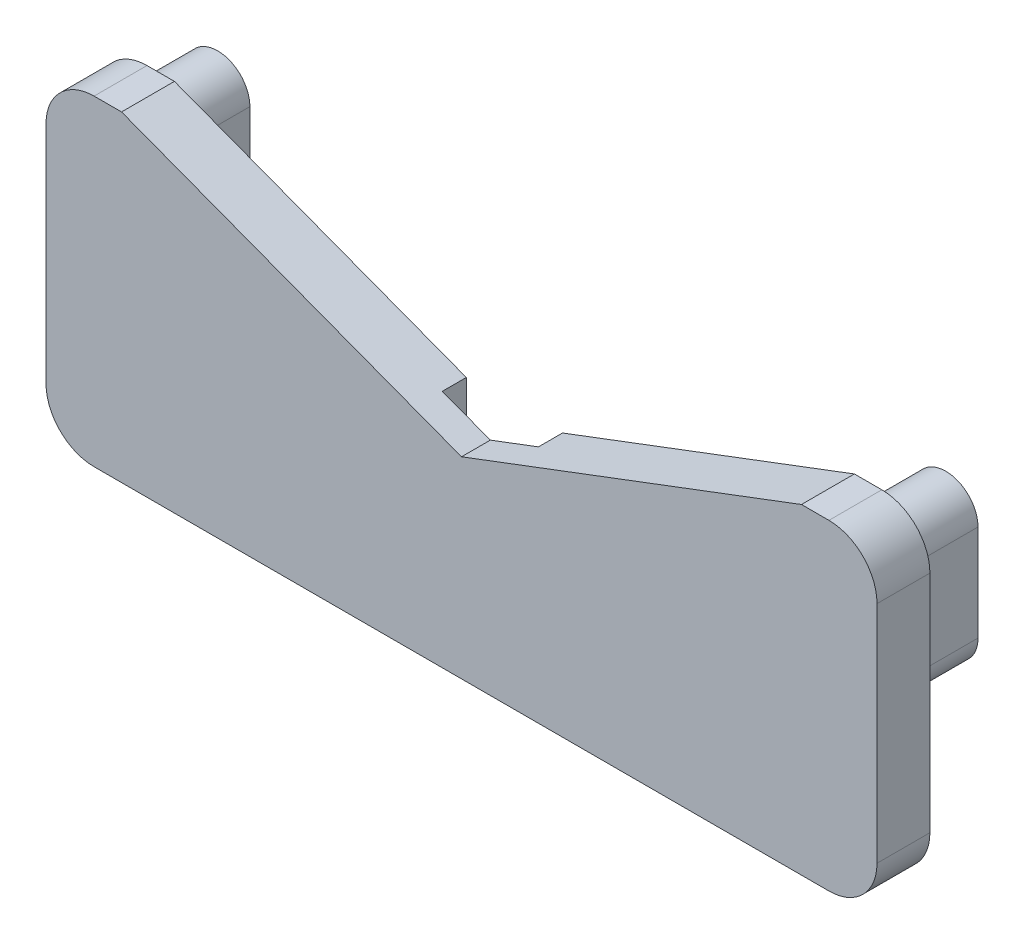
ISO-10303-21;
HEADER;
FILE_DESCRIPTION(('STEP AP214'),'2;1');
FILE_NAME('part.step','',(''),(''),'','','');
FILE_SCHEMA(('AUTOMOTIVE_DESIGN { 1 0 10303 214 1 1 1 1 }'));
ENDSEC;
DATA;
#1=APPLICATION_CONTEXT('core data for automotive mechanical design processes');
#2=APPLICATION_PROTOCOL_DEFINITION('international standard','automotive_design',2000,#1);
#3=PRODUCT_CONTEXT('',#1,'mechanical');
#4=PRODUCT('Part','Part','',(#3));
#5=PRODUCT_RELATED_PRODUCT_CATEGORY('part','',(#4));
#6=PRODUCT_DEFINITION_FORMATION('','',#4);
#7=PRODUCT_DEFINITION_CONTEXT('part definition',#1,'design');
#8=PRODUCT_DEFINITION('design','',#6,#7);
#9=PRODUCT_DEFINITION_SHAPE('','',#8);
#10=(LENGTH_UNIT() NAMED_UNIT(*) SI_UNIT(.MILLI.,.METRE.));
#11=(NAMED_UNIT(*) PLANE_ANGLE_UNIT() SI_UNIT($,.RADIAN.));
#12=(NAMED_UNIT(*) SI_UNIT($,.STERADIAN.) SOLID_ANGLE_UNIT());
#13=UNCERTAINTY_MEASURE_WITH_UNIT(LENGTH_MEASURE(1.E-05),#10,'distance_accuracy_value','');
#14=(GEOMETRIC_REPRESENTATION_CONTEXT(3) GLOBAL_UNCERTAINTY_ASSIGNED_CONTEXT((#13)) GLOBAL_UNIT_ASSIGNED_CONTEXT((#10,
#11,#12)) REPRESENTATION_CONTEXT('',''));
#15=CARTESIAN_POINT('',(0.,0.,0.));
#16=DIRECTION('',(0.,0.,1.));
#17=DIRECTION('',(1.,0.,0.));
#18=AXIS2_PLACEMENT_3D('',#15,#16,#17);
#19=CARTESIAN_POINT('',(-38.2,11.6881792815469,2.5));
#20=DIRECTION('',(0.,0.,1.));
#21=DIRECTION('',(1.,0.,0.));
#22=AXIS2_PLACEMENT_3D('',#19,#20,#21);
#23=PLANE('',#22);
#24=DIRECTION('',(0.,-1.,0.));
#25=VECTOR('',#24,1.);
#26=CARTESIAN_POINT('',(5.,0.,2.5));
#27=LINE('',#26,#25);
#28=CARTESIAN_POINT('',(5.,5.20398691330567,2.5));
#29=VERTEX_POINT('',#28);
#30=CARTESIAN_POINT('',(5.,-16.6881792815469,2.5));
#31=VERTEX_POINT('',#30);
#32=EDGE_CURVE('E261',#29,#31,#27,.T.);
#33=ORIENTED_EDGE('',*,*,#32,.T.);
#34=DIRECTION('',(-1.,0.,0.));
#35=VECTOR('',#34,1.);
#36=CARTESIAN_POINT('',(0.,-16.6881792815469,2.5));
#37=LINE('',#36,#35);
#38=CARTESIAN_POINT('',(-5.,-16.6881792815469,2.5));
#39=VERTEX_POINT('',#38);
#40=EDGE_CURVE('E287',#31,#39,#37,.T.);
#41=ORIENTED_EDGE('',*,*,#40,.T.);
#42=DIRECTION('',(0.,-1.,0.));
#43=VECTOR('',#42,1.);
#44=CARTESIAN_POINT('',(-5.,0.,2.5));
#45=LINE('',#44,#43);
#46=CARTESIAN_POINT('',(-5.,5.20398691330567,2.5));
#47=VERTEX_POINT('',#46);
#48=EDGE_CURVE('E337',#47,#39,#45,.T.);
#49=ORIENTED_EDGE('',*,*,#48,.F.);
#50=DIRECTION('',(-0.935269273451054,0.353936980461688,0.));
#51=VECTOR('',#50,1.);
#52=CARTESIAN_POINT('',(1.09630003212957,2.89694434641078,2.5));
#53=LINE('',#52,#51);
#54=CARTESIAN_POINT('',(0.,3.31182071845306,2.5));
#55=VERTEX_POINT('',#54);
#56=EDGE_CURVE('E292',#55,#47,#53,.T.);
#57=ORIENTED_EDGE('',*,*,#56,.F.);
#58=DIRECTION('',(-0.935269273451054,-0.353936980461688,0.));
#59=VECTOR('',#58,1.);
#60=CARTESIAN_POINT('',(-1.09630003212957,2.89694434641079,2.5));
#61=LINE('',#60,#59);
#62=EDGE_CURVE('E320',#29,#55,#61,.T.);
#63=ORIENTED_EDGE('',*,*,#62,.F.);
#64=EDGE_LOOP('',(#33,#41,#49,#57,#63));
#65=FACE_BOUND('',#64,.T.);
#66=ADVANCED_FACE('F36',(#65),#23,.F.);
#67=CARTESIAN_POINT('',(-38.2,11.6881792815469,2.5));
#68=DIRECTION('',(0.,0.,-1.));
#69=DIRECTION('',(-1.,0.,0.));
#70=AXIS2_PLACEMENT_3D('',#67,#68,#69);
#71=CYLINDRICAL_SURFACE('',#70,5.);
#72=CARTESIAN_POINT('',(-38.2,11.6881792815469,0.));
#73=DIRECTION('',(0.,0.,1.));
#74=DIRECTION('',(1.,0.,0.));
#75=AXIS2_PLACEMENT_3D('',#72,#73,#74);
#76=CIRCLE('',#75,5.);
#77=CARTESIAN_POINT('',(-43.2,11.6881792815469,0.));
#78=VERTEX_POINT('',#77);
#79=CARTESIAN_POINT('',(-38.2,16.6881792815469,0.));
#80=VERTEX_POINT('',#79);
#81=EDGE_CURVE('E336',#78,#80,#76,.F.);
#82=ORIENTED_EDGE('',*,*,#81,.F.);
#83=DIRECTION('',(0.,0.,-1.));
#84=VECTOR('',#83,1.);
#85=CARTESIAN_POINT('',(-43.2,11.6881792815469,2.5));
#86=LINE('',#85,#84);
#87=CARTESIAN_POINT('',(-43.2,11.6881792815469,5.5));
#88=VERTEX_POINT('',#87);
#89=EDGE_CURVE('E11',#88,#78,#86,.T.);
#90=ORIENTED_EDGE('',*,*,#89,.F.);
#91=CARTESIAN_POINT('',(-38.2,11.6881792815469,5.5));
#92=DIRECTION('',(0.,0.,1.));
#93=DIRECTION('',(1.,0.,0.));
#94=AXIS2_PLACEMENT_3D('',#91,#92,#93);
#95=CIRCLE('',#94,5.);
#96=CARTESIAN_POINT('',(-38.2,16.6881792815469,5.5));
#97=VERTEX_POINT('',#96);
#98=EDGE_CURVE('E291',#97,#88,#95,.T.);
#99=ORIENTED_EDGE('',*,*,#98,.F.);
#100=DIRECTION('',(0.,0.,-1.));
#101=VECTOR('',#100,1.);
#102=CARTESIAN_POINT('',(-38.2,16.6881792815469,2.5));
#103=LINE('',#102,#101);
#104=EDGE_CURVE('E340',#97,#80,#103,.T.);
#105=ORIENTED_EDGE('',*,*,#104,.T.);
#106=EDGE_LOOP('',(#82,#90,#99,#105));
#107=FACE_BOUND('',#106,.T.);
#108=ADVANCED_FACE('F38',(#107),#71,.T.);
#109=CARTESIAN_POINT('',(-43.2,0.,2.5));
#110=DIRECTION('',(-1.,0.,0.));
#111=DIRECTION('',(0.,0.,1.));
#112=AXIS2_PLACEMENT_3D('',#109,#110,#111);
#113=PLANE('',#112);
#114=DIRECTION('',(0.,1.,0.));
#115=VECTOR('',#114,1.);
#116=CARTESIAN_POINT('',(-43.2,0.,0.));
#117=LINE('',#116,#115);
#118=CARTESIAN_POINT('',(-43.2,-11.6881792815469,0.));
#119=VERTEX_POINT('',#118);
#120=EDGE_CURVE('E344',#119,#78,#117,.T.);
#121=ORIENTED_EDGE('',*,*,#120,.F.);
#122=DIRECTION('',(0.,0.,-1.));
#123=VECTOR('',#122,1.);
#124=CARTESIAN_POINT('',(-43.2,-11.6881792815469,2.5));
#125=LINE('',#124,#123);
#126=CARTESIAN_POINT('',(-43.2,-11.6881792815469,5.5));
#127=VERTEX_POINT('',#126);
#128=EDGE_CURVE('E44',#127,#119,#125,.T.);
#129=ORIENTED_EDGE('',*,*,#128,.F.);
#130=DIRECTION('',(0.,-1.,0.));
#131=VECTOR('',#130,1.);
#132=CARTESIAN_POINT('',(-43.2,0.,5.5));
#133=LINE('',#132,#131);
#134=EDGE_CURVE('E295',#88,#127,#133,.T.);
#135=ORIENTED_EDGE('',*,*,#134,.F.);
#136=ORIENTED_EDGE('',*,*,#89,.T.);
#137=EDGE_LOOP('',(#121,#129,#135,#136));
#138=FACE_BOUND('',#137,.T.);
#139=ADVANCED_FACE('F376',(#138),#113,.T.);
#140=CARTESIAN_POINT('',(-38.2,-11.6881792815469,2.5));
#141=DIRECTION('',(0.,0.,-1.));
#142=DIRECTION('',(-1.,0.,0.));
#143=AXIS2_PLACEMENT_3D('',#140,#141,#142);
#144=CYLINDRICAL_SURFACE('',#143,5.);
#145=CARTESIAN_POINT('',(-38.2,-11.6881792815469,0.));
#146=DIRECTION('',(0.,0.,1.));
#147=DIRECTION('',(1.,0.,0.));
#148=AXIS2_PLACEMENT_3D('',#145,#146,#147);
#149=CIRCLE('',#148,5.);
#150=CARTESIAN_POINT('',(-38.2,-16.6881792815469,0.));
#151=VERTEX_POINT('',#150);
#152=EDGE_CURVE('E347',#151,#119,#149,.F.);
#153=ORIENTED_EDGE('',*,*,#152,.F.);
#154=DIRECTION('',(0.,0.,-1.));
#155=VECTOR('',#154,1.);
#156=CARTESIAN_POINT('',(-38.2,-16.6881792815469,2.5));
#157=LINE('',#156,#155);
#158=CARTESIAN_POINT('',(-38.2,-16.6881792815469,5.5));
#159=VERTEX_POINT('',#158);
#160=EDGE_CURVE('E368',#159,#151,#157,.T.);
#161=ORIENTED_EDGE('',*,*,#160,.F.);
#162=CARTESIAN_POINT('',(-38.2,-11.6881792815469,5.5));
#163=DIRECTION('',(0.,0.,1.));
#164=DIRECTION('',(1.,0.,0.));
#165=AXIS2_PLACEMENT_3D('',#162,#163,#164);
#166=CIRCLE('',#165,5.);
#167=EDGE_CURVE('E298',#127,#159,#166,.T.);
#168=ORIENTED_EDGE('',*,*,#167,.F.);
#169=ORIENTED_EDGE('',*,*,#128,.T.);
#170=EDGE_LOOP('',(#153,#161,#168,#169));
#171=FACE_BOUND('',#170,.T.);
#172=ADVANCED_FACE('F373',(#171),#144,.T.);
#173=CARTESIAN_POINT('',(0.,-16.6881792815469,2.5));
#174=DIRECTION('',(0.,1.,0.));
#175=DIRECTION('',(0.,0.,1.));
#176=AXIS2_PLACEMENT_3D('',#173,#174,#175);
#177=PLANE('',#176);
#178=DIRECTION('',(1.,0.,0.));
#179=VECTOR('',#178,1.);
#180=CARTESIAN_POINT('',(0.,-16.6881792815469,0.));
#181=LINE('',#180,#179);
#182=CARTESIAN_POINT('',(-5.,-16.6881792815469,0.));
#183=VERTEX_POINT('',#182);
#184=EDGE_CURVE('E350',#151,#183,#181,.T.);
#185=ORIENTED_EDGE('',*,*,#184,.T.);
#186=DIRECTION('',(0.,0.,-1.));
#187=VECTOR('',#186,1.);
#188=CARTESIAN_POINT('',(-5.,-16.6881792815469,2.5));
#189=LINE('',#188,#187);
#190=EDGE_CURVE('E366',#39,#183,#189,.T.);
#191=ORIENTED_EDGE('',*,*,#190,.F.);
#192=ORIENTED_EDGE('',*,*,#40,.F.);
#193=DIRECTION('',(0.,0.,-1.));
#194=VECTOR('',#193,1.);
#195=CARTESIAN_POINT('',(5.,-16.6881792815469,2.5));
#196=LINE('',#195,#194);
#197=CARTESIAN_POINT('',(5.,-16.6881792815469,0.));
#198=VERTEX_POINT('',#197);
#199=EDGE_CURVE('E263',#31,#198,#196,.T.);
#200=ORIENTED_EDGE('',*,*,#199,.T.);
#201=DIRECTION('',(1.,0.,0.));
#202=VECTOR('',#201,1.);
#203=CARTESIAN_POINT('',(0.,-16.6881792815469,0.));
#204=LINE('',#203,#202);
#205=CARTESIAN_POINT('',(38.2,-16.6881792815469,0.));
#206=VERTEX_POINT('',#205);
#207=EDGE_CURVE('E275',#198,#206,#204,.T.);
#208=ORIENTED_EDGE('',*,*,#207,.T.);
#209=DIRECTION('',(0.,0.,-1.));
#210=VECTOR('',#209,1.);
#211=CARTESIAN_POINT('',(38.2,-16.6881792815469,5.5));
#212=LINE('',#211,#210);
#213=CARTESIAN_POINT('',(38.2,-16.6881792815469,5.5));
#214=VERTEX_POINT('',#213);
#215=EDGE_CURVE('E334',#214,#206,#212,.T.);
#216=ORIENTED_EDGE('',*,*,#215,.F.);
#217=DIRECTION('',(-1.,0.,0.));
#218=VECTOR('',#217,1.);
#219=CARTESIAN_POINT('',(0.,-16.6881792815469,5.5));
#220=LINE('',#219,#218);
#221=EDGE_CURVE('E301',#214,#159,#220,.T.);
#222=ORIENTED_EDGE('',*,*,#221,.T.);
#223=ORIENTED_EDGE('',*,*,#160,.T.);
#224=EDGE_LOOP('',(#185,#191,#192,#200,#208,#216,#222,#223));
#225=FACE_BOUND('',#224,.T.);
#226=ADVANCED_FACE('F384',(#225),#177,.F.);
#227=CARTESIAN_POINT('',(-5.,0.,2.5));
#228=DIRECTION('',(1.,0.,0.));
#229=DIRECTION('',(0.,1.,0.));
#230=AXIS2_PLACEMENT_3D('',#227,#228,#229);
#231=PLANE('',#230);
#232=DIRECTION('',(0.,-1.,0.));
#233=VECTOR('',#232,1.);
#234=CARTESIAN_POINT('',(-5.,0.,0.));
#235=LINE('',#234,#233);
#236=CARTESIAN_POINT('',(-5.,5.20398691330567,0.));
#237=VERTEX_POINT('',#236);
#238=EDGE_CURVE('E353',#237,#183,#235,.T.);
#239=ORIENTED_EDGE('',*,*,#238,.F.);
#240=DIRECTION('',(0.,0.,-1.));
#241=VECTOR('',#240,1.);
#242=CARTESIAN_POINT('',(-5.,5.20398691330567,2.5));
#243=LINE('',#242,#241);
#244=EDGE_CURVE('E364',#47,#237,#243,.T.);
#245=ORIENTED_EDGE('',*,*,#244,.F.);
#246=ORIENTED_EDGE('',*,*,#48,.T.);
#247=ORIENTED_EDGE('',*,*,#190,.T.);
#248=EDGE_LOOP('',(#239,#245,#246,#247));
#249=FACE_BOUND('',#248,.T.);
#250=ADVANCED_FACE('F402',(#249),#231,.T.);
#251=CARTESIAN_POINT('',(1.09630003212957,2.89694434641078,2.5));
#252=DIRECTION('',(0.353936980461688,0.935269273451054,0.));
#253=DIRECTION('',(-0.935269273451054,0.353936980461688,0.));
#254=AXIS2_PLACEMENT_3D('',#251,#252,#253);
#255=PLANE('',#254);
#256=DIRECTION('',(0.935269273451054,-0.353936980461688,0.));
#257=VECTOR('',#256,1.);
#258=CARTESIAN_POINT('',(1.09630003212957,2.89694434641078,0.));
#259=LINE('',#258,#257);
#260=CARTESIAN_POINT('',(-35.3466799044464,16.6881792815469,0.));
#261=VERTEX_POINT('',#260);
#262=EDGE_CURVE('E356',#261,#237,#259,.T.);
#263=ORIENTED_EDGE('',*,*,#262,.F.);
#264=DIRECTION('',(0.,0.,-1.));
#265=VECTOR('',#264,1.);
#266=CARTESIAN_POINT('',(-35.3466799044464,16.6881792815469,2.5));
#267=LINE('',#266,#265);
#268=CARTESIAN_POINT('',(-35.3466799044464,16.6881792815469,5.5));
#269=VERTEX_POINT('',#268);
#270=EDGE_CURVE('E362',#269,#261,#267,.T.);
#271=ORIENTED_EDGE('',*,*,#270,.F.);
#272=DIRECTION('',(-0.935269273451054,0.353936980461688,0.));
#273=VECTOR('',#272,1.);
#274=CARTESIAN_POINT('',(1.09630003212957,2.89694434641078,5.5));
#275=LINE('',#274,#273);
#276=CARTESIAN_POINT('',(0.,3.31182071845306,5.5));
#277=VERTEX_POINT('',#276);
#278=EDGE_CURVE('E315',#277,#269,#275,.T.);
#279=ORIENTED_EDGE('',*,*,#278,.F.);
#280=DIRECTION('',(0.,0.,-1.));
#281=VECTOR('',#280,1.);
#282=CARTESIAN_POINT('',(0.,3.31182071845306,5.5));
#283=LINE('',#282,#281);
#284=EDGE_CURVE('E318',#277,#55,#283,.T.);
#285=ORIENTED_EDGE('',*,*,#284,.T.);
#286=ORIENTED_EDGE('',*,*,#56,.T.);
#287=ORIENTED_EDGE('',*,*,#244,.T.);
#288=EDGE_LOOP('',(#263,#271,#279,#285,#286,#287));
#289=FACE_BOUND('',#288,.T.);
#290=ADVANCED_FACE('F398',(#289),#255,.T.);
#291=CARTESIAN_POINT('',(0.,16.6881792815469,2.5));
#292=DIRECTION('',(0.,1.,0.));
#293=DIRECTION('',(0.,0.,1.));
#294=AXIS2_PLACEMENT_3D('',#291,#292,#293);
#295=PLANE('',#294);
#296=DIRECTION('',(1.,0.,0.));
#297=VECTOR('',#296,1.);
#298=CARTESIAN_POINT('',(0.,16.6881792815469,0.));
#299=LINE('',#298,#297);
#300=EDGE_CURVE('E341',#80,#261,#299,.T.);
#301=ORIENTED_EDGE('',*,*,#300,.F.);
#302=ORIENTED_EDGE('',*,*,#104,.F.);
#303=DIRECTION('',(-1.,0.,0.));
#304=VECTOR('',#303,1.);
#305=CARTESIAN_POINT('',(0.,16.6881792815469,5.5));
#306=LINE('',#305,#304);
#307=EDGE_CURVE('E288',#269,#97,#306,.T.);
#308=ORIENTED_EDGE('',*,*,#307,.F.);
#309=ORIENTED_EDGE('',*,*,#270,.T.);
#310=EDGE_LOOP('',(#301,#302,#308,#309));
#311=FACE_BOUND('',#310,.T.);
#312=ADVANCED_FACE('F394',(#311),#295,.T.);
#313=CARTESIAN_POINT('',(0.,0.,0.));
#314=DIRECTION('',(0.,0.,1.));
#315=DIRECTION('',(1.,0.,0.));
#316=AXIS2_PLACEMENT_3D('',#313,#314,#315);
#317=PLANE('',#316);
#318=CARTESIAN_POINT('',(-37.85,11.3381792815469,0.));
#319=DIRECTION('',(0.,0.,1.));
#320=DIRECTION('',(1.,0.,0.));
#321=AXIS2_PLACEMENT_3D('',#318,#319,#320);
#322=CIRCLE('',#321,3.35);
#323=CARTESIAN_POINT('',(-34.5,11.3381792815469,0.));
#324=VERTEX_POINT('',#323);
#325=CARTESIAN_POINT('',(-41.2,11.3381792815469,0.));
#326=VERTEX_POINT('',#325);
#327=EDGE_CURVE('E216',#324,#326,#322,.T.);
#328=ORIENTED_EDGE('',*,*,#327,.T.);
#329=DIRECTION('',(0.,-1.,0.));
#330=VECTOR('',#329,1.);
#331=CARTESIAN_POINT('',(-41.2,0.,0.));
#332=LINE('',#331,#330);
#333=CARTESIAN_POINT('',(-41.2,1.33817928154693,0.));
#334=VERTEX_POINT('',#333);
#335=EDGE_CURVE('E223',#326,#334,#332,.T.);
#336=ORIENTED_EDGE('',*,*,#335,.T.);
#337=CARTESIAN_POINT('',(-37.85,1.33817928154693,0.));
#338=DIRECTION('',(0.,0.,1.));
#339=DIRECTION('',(1.,0.,0.));
#340=AXIS2_PLACEMENT_3D('',#337,#338,#339);
#341=CIRCLE('',#340,3.35);
#342=CARTESIAN_POINT('',(-34.5,1.33817928154693,0.));
#343=VERTEX_POINT('',#342);
#344=EDGE_CURVE('E197',#334,#343,#341,.T.);
#345=ORIENTED_EDGE('',*,*,#344,.T.);
#346=DIRECTION('',(0.,-1.,0.));
#347=VECTOR('',#346,1.);
#348=CARTESIAN_POINT('',(-34.5,0.,0.));
#349=LINE('',#348,#347);
#350=EDGE_CURVE('E51',#324,#343,#349,.T.);
#351=ORIENTED_EDGE('',*,*,#350,.F.);
#352=EDGE_LOOP('',(#328,#336,#345,#351));
#353=FACE_BOUND('',#352,.T.);
#354=ORIENTED_EDGE('',*,*,#81,.T.);
#355=ORIENTED_EDGE('',*,*,#300,.T.);
#356=ORIENTED_EDGE('',*,*,#262,.T.);
#357=ORIENTED_EDGE('',*,*,#238,.T.);
#358=ORIENTED_EDGE('',*,*,#184,.F.);
#359=ORIENTED_EDGE('',*,*,#152,.T.);
#360=ORIENTED_EDGE('',*,*,#120,.T.);
#361=EDGE_LOOP('',(#354,#355,#356,#357,#358,#359,#360));
#362=FACE_BOUND('',#361,.T.);
#363=ADVANCED_FACE('F380',(#353,#362),#317,.F.);
#364=CARTESIAN_POINT('',(38.2,-11.6881792815469,5.5));
#365=DIRECTION('',(0.,0.,-1.));
#366=DIRECTION('',(-1.,0.,0.));
#367=AXIS2_PLACEMENT_3D('',#364,#365,#366);
#368=CYLINDRICAL_SURFACE('',#367,5.);
#369=ORIENTED_EDGE('',*,*,#215,.T.);
#370=CARTESIAN_POINT('',(38.2,-11.6881792815469,0.));
#371=DIRECTION('',(0.,0.,1.));
#372=DIRECTION('',(1.,0.,0.));
#373=AXIS2_PLACEMENT_3D('',#370,#371,#372);
#374=CIRCLE('',#373,5.);
#375=CARTESIAN_POINT('',(43.2,-11.6881792815469,0.));
#376=VERTEX_POINT('',#375);
#377=EDGE_CURVE('E278',#206,#376,#374,.T.);
#378=ORIENTED_EDGE('',*,*,#377,.T.);
#379=DIRECTION('',(0.,0.,-1.));
#380=VECTOR('',#379,1.);
#381=CARTESIAN_POINT('',(43.2,-11.6881792815469,5.5));
#382=LINE('',#381,#380);
#383=CARTESIAN_POINT('',(43.2,-11.6881792815469,5.5));
#384=VERTEX_POINT('',#383);
#385=EDGE_CURVE('E332',#384,#376,#382,.T.);
#386=ORIENTED_EDGE('',*,*,#385,.F.);
#387=CARTESIAN_POINT('',(38.2,-11.6881792815469,5.5));
#388=DIRECTION('',(0.,0.,1.));
#389=DIRECTION('',(1.,0.,0.));
#390=AXIS2_PLACEMENT_3D('',#387,#388,#389);
#391=CIRCLE('',#390,5.);
#392=EDGE_CURVE('E304',#214,#384,#391,.T.);
#393=ORIENTED_EDGE('',*,*,#392,.F.);
#394=EDGE_LOOP('',(#369,#378,#386,#393));
#395=FACE_BOUND('',#394,.T.);
#396=ADVANCED_FACE('F436',(#395),#368,.T.);
#397=CARTESIAN_POINT('',(43.2,0.,5.5));
#398=DIRECTION('',(1.,0.,0.));
#399=DIRECTION('',(0.,0.,-1.));
#400=AXIS2_PLACEMENT_3D('',#397,#398,#399);
#401=PLANE('',#400);
#402=ORIENTED_EDGE('',*,*,#385,.T.);
#403=DIRECTION('',(0.,1.,0.));
#404=VECTOR('',#403,1.);
#405=CARTESIAN_POINT('',(43.2,0.,0.));
#406=LINE('',#405,#404);
#407=CARTESIAN_POINT('',(43.2,11.6881792815469,0.));
#408=VERTEX_POINT('',#407);
#409=EDGE_CURVE('E264',#376,#408,#406,.T.);
#410=ORIENTED_EDGE('',*,*,#409,.T.);
#411=DIRECTION('',(0.,0.,-1.));
#412=VECTOR('',#411,1.);
#413=CARTESIAN_POINT('',(43.2,11.6881792815469,5.5));
#414=LINE('',#413,#412);
#415=CARTESIAN_POINT('',(43.2,11.6881792815469,5.5));
#416=VERTEX_POINT('',#415);
#417=EDGE_CURVE('E330',#416,#408,#414,.T.);
#418=ORIENTED_EDGE('',*,*,#417,.F.);
#419=DIRECTION('',(0.,-1.,0.));
#420=VECTOR('',#419,1.);
#421=CARTESIAN_POINT('',(43.2,0.,5.5));
#422=LINE('',#421,#420);
#423=EDGE_CURVE('E306',#416,#384,#422,.T.);
#424=ORIENTED_EDGE('',*,*,#423,.T.);
#425=EDGE_LOOP('',(#402,#410,#418,#424));
#426=FACE_BOUND('',#425,.T.);
#427=ADVANCED_FACE('F432',(#426),#401,.T.);
#428=CARTESIAN_POINT('',(38.2,11.6881792815469,5.5));
#429=DIRECTION('',(0.,0.,-1.));
#430=DIRECTION('',(-1.,0.,0.));
#431=AXIS2_PLACEMENT_3D('',#428,#429,#430);
#432=CYLINDRICAL_SURFACE('',#431,5.);
#433=ORIENTED_EDGE('',*,*,#417,.T.);
#434=CARTESIAN_POINT('',(38.2,11.6881792815469,0.));
#435=DIRECTION('',(0.,0.,1.));
#436=DIRECTION('',(1.,0.,0.));
#437=AXIS2_PLACEMENT_3D('',#434,#435,#436);
#438=CIRCLE('',#437,5.);
#439=CARTESIAN_POINT('',(38.2,16.6881792815469,0.));
#440=VERTEX_POINT('',#439);
#441=EDGE_CURVE('E255',#440,#408,#438,.F.);
#442=ORIENTED_EDGE('',*,*,#441,.F.);
#443=DIRECTION('',(0.,0.,-1.));
#444=VECTOR('',#443,1.);
#445=CARTESIAN_POINT('',(38.2,16.6881792815469,5.5));
#446=LINE('',#445,#444);
#447=CARTESIAN_POINT('',(38.2,16.6881792815469,5.5));
#448=VERTEX_POINT('',#447);
#449=EDGE_CURVE('E328',#448,#440,#446,.T.);
#450=ORIENTED_EDGE('',*,*,#449,.F.);
#451=CARTESIAN_POINT('',(38.2,11.6881792815469,5.5));
#452=DIRECTION('',(0.,0.,1.));
#453=DIRECTION('',(1.,0.,0.));
#454=AXIS2_PLACEMENT_3D('',#451,#452,#453);
#455=CIRCLE('',#454,5.);
#456=EDGE_CURVE('E309',#416,#448,#455,.T.);
#457=ORIENTED_EDGE('',*,*,#456,.F.);
#458=EDGE_LOOP('',(#433,#442,#450,#457));
#459=FACE_BOUND('',#458,.T.);
#460=ADVANCED_FACE('F428',(#459),#432,.T.);
#461=CARTESIAN_POINT('',(0.,16.6881792815469,5.5));
#462=DIRECTION('',(0.,-1.,0.));
#463=DIRECTION('',(0.,0.,-1.));
#464=AXIS2_PLACEMENT_3D('',#461,#462,#463);
#465=PLANE('',#464);
#466=ORIENTED_EDGE('',*,*,#449,.T.);
#467=DIRECTION('',(1.,0.,0.));
#468=VECTOR('',#467,1.);
#469=CARTESIAN_POINT('',(0.,16.6881792815469,0.));
#470=LINE('',#469,#468);
#471=CARTESIAN_POINT('',(35.3466799044464,16.6881792815469,0.));
#472=VERTEX_POINT('',#471);
#473=EDGE_CURVE('E267',#472,#440,#470,.T.);
#474=ORIENTED_EDGE('',*,*,#473,.F.);
#475=DIRECTION('',(0.,0.,-1.));
#476=VECTOR('',#475,1.);
#477=CARTESIAN_POINT('',(35.3466799044464,16.6881792815469,5.5));
#478=LINE('',#477,#476);
#479=CARTESIAN_POINT('',(35.3466799044464,16.6881792815469,5.5));
#480=VERTEX_POINT('',#479);
#481=EDGE_CURVE('E326',#480,#472,#478,.T.);
#482=ORIENTED_EDGE('',*,*,#481,.F.);
#483=DIRECTION('',(-1.,0.,0.));
#484=VECTOR('',#483,1.);
#485=CARTESIAN_POINT('',(0.,16.6881792815469,5.5));
#486=LINE('',#485,#484);
#487=EDGE_CURVE('E311',#448,#480,#486,.T.);
#488=ORIENTED_EDGE('',*,*,#487,.F.);
#489=EDGE_LOOP('',(#466,#474,#482,#488));
#490=FACE_BOUND('',#489,.T.);
#491=ADVANCED_FACE('F423',(#490),#465,.F.);
#492=CARTESIAN_POINT('',(-1.09630003212957,2.89694434641079,5.5));
#493=DIRECTION('',(0.353936980461688,-0.935269273451054,0.));
#494=DIRECTION('',(0.935269273451054,0.353936980461688,0.));
#495=AXIS2_PLACEMENT_3D('',#492,#493,#494);
#496=PLANE('',#495);
#497=ORIENTED_EDGE('',*,*,#481,.T.);
#498=DIRECTION('',(0.935269273451054,0.353936980461688,0.));
#499=VECTOR('',#498,1.);
#500=CARTESIAN_POINT('',(-1.09630003212957,2.89694434641079,0.));
#501=LINE('',#500,#499);
#502=CARTESIAN_POINT('',(5.,5.20398691330567,0.));
#503=VERTEX_POINT('',#502);
#504=EDGE_CURVE('E270',#503,#472,#501,.T.);
#505=ORIENTED_EDGE('',*,*,#504,.F.);
#506=DIRECTION('',(0.,0.,-1.));
#507=VECTOR('',#506,1.);
#508=CARTESIAN_POINT('',(5.,5.20398691330567,2.5));
#509=LINE('',#508,#507);
#510=EDGE_CURVE('E285',#29,#503,#509,.T.);
#511=ORIENTED_EDGE('',*,*,#510,.F.);
#512=ORIENTED_EDGE('',*,*,#62,.T.);
#513=ORIENTED_EDGE('',*,*,#284,.F.);
#514=DIRECTION('',(-0.935269273451054,-0.353936980461688,0.));
#515=VECTOR('',#514,1.);
#516=CARTESIAN_POINT('',(-1.09630003212957,2.89694434641079,5.5));
#517=LINE('',#516,#515);
#518=EDGE_CURVE('E313',#480,#277,#517,.T.);
#519=ORIENTED_EDGE('',*,*,#518,.F.);
#520=EDGE_LOOP('',(#497,#505,#511,#512,#513,#519));
#521=FACE_BOUND('',#520,.T.);
#522=ADVANCED_FACE('F416',(#521),#496,.F.);
#523=CARTESIAN_POINT('',(-38.2,11.6881792815469,5.5));
#524=DIRECTION('',(0.,0.,1.));
#525=DIRECTION('',(1.,0.,0.));
#526=AXIS2_PLACEMENT_3D('',#523,#524,#525);
#527=PLANE('',#526);
#528=ORIENTED_EDGE('',*,*,#307,.T.);
#529=ORIENTED_EDGE('',*,*,#98,.T.);
#530=ORIENTED_EDGE('',*,*,#134,.T.);
#531=ORIENTED_EDGE('',*,*,#167,.T.);
#532=ORIENTED_EDGE('',*,*,#221,.F.);
#533=ORIENTED_EDGE('',*,*,#392,.T.);
#534=ORIENTED_EDGE('',*,*,#423,.F.);
#535=ORIENTED_EDGE('',*,*,#456,.T.);
#536=ORIENTED_EDGE('',*,*,#487,.T.);
#537=ORIENTED_EDGE('',*,*,#518,.T.);
#538=ORIENTED_EDGE('',*,*,#278,.T.);
#539=EDGE_LOOP('',(#528,#529,#530,#531,#532,#533,#534,#535,#536,#537,#538));
#540=FACE_BOUND('',#539,.T.);
#541=ADVANCED_FACE('F388',(#540),#527,.T.);
#542=CARTESIAN_POINT('',(5.,0.,2.5));
#543=DIRECTION('',(1.,0.,0.));
#544=DIRECTION('',(0.,1.,0.));
#545=AXIS2_PLACEMENT_3D('',#542,#543,#544);
#546=PLANE('',#545);
#547=DIRECTION('',(0.,-1.,0.));
#548=VECTOR('',#547,1.);
#549=CARTESIAN_POINT('',(5.,0.,0.));
#550=LINE('',#549,#548);
#551=EDGE_CURVE('E273',#503,#198,#550,.T.);
#552=ORIENTED_EDGE('',*,*,#551,.T.);
#553=ORIENTED_EDGE('',*,*,#199,.F.);
#554=ORIENTED_EDGE('',*,*,#32,.F.);
#555=ORIENTED_EDGE('',*,*,#510,.T.);
#556=EDGE_LOOP('',(#552,#553,#554,#555));
#557=FACE_BOUND('',#556,.T.);
#558=ADVANCED_FACE('F408',(#557),#546,.F.);
#559=CARTESIAN_POINT('',(0.,0.,0.));
#560=DIRECTION('',(0.,0.,1.));
#561=DIRECTION('',(1.,0.,0.));
#562=AXIS2_PLACEMENT_3D('',#559,#560,#561);
#563=PLANE('',#562);
#564=CARTESIAN_POINT('',(37.85,11.3381792815469,0.));
#565=DIRECTION('',(0.,0.,1.));
#566=DIRECTION('',(1.,0.,0.));
#567=AXIS2_PLACEMENT_3D('',#564,#565,#566);
#568=CIRCLE('',#567,3.35);
#569=CARTESIAN_POINT('',(41.2,11.3381792815469,0.));
#570=VERTEX_POINT('',#569);
#571=CARTESIAN_POINT('',(34.5,11.3381792815469,0.));
#572=VERTEX_POINT('',#571);
#573=EDGE_CURVE('E236',#570,#572,#568,.T.);
#574=ORIENTED_EDGE('',*,*,#573,.T.);
#575=DIRECTION('',(0.,-1.,0.));
#576=VECTOR('',#575,1.);
#577=CARTESIAN_POINT('',(34.5,0.,0.));
#578=LINE('',#577,#576);
#579=CARTESIAN_POINT('',(34.5,1.33817928154693,0.));
#580=VERTEX_POINT('',#579);
#581=EDGE_CURVE('E228',#572,#580,#578,.T.);
#582=ORIENTED_EDGE('',*,*,#581,.T.);
#583=CARTESIAN_POINT('',(37.85,1.33817928154693,0.));
#584=DIRECTION('',(0.,0.,1.));
#585=DIRECTION('',(1.,0.,0.));
#586=AXIS2_PLACEMENT_3D('',#583,#584,#585);
#587=CIRCLE('',#586,3.35);
#588=CARTESIAN_POINT('',(41.2,1.33817928154693,0.));
#589=VERTEX_POINT('',#588);
#590=EDGE_CURVE('E247',#580,#589,#587,.T.);
#591=ORIENTED_EDGE('',*,*,#590,.T.);
#592=DIRECTION('',(0.,-1.,0.));
#593=VECTOR('',#592,1.);
#594=CARTESIAN_POINT('',(41.2,0.,0.));
#595=LINE('',#594,#593);
#596=EDGE_CURVE('E59',#570,#589,#595,.T.);
#597=ORIENTED_EDGE('',*,*,#596,.F.);
#598=EDGE_LOOP('',(#574,#582,#591,#597));
#599=FACE_BOUND('',#598,.T.);
#600=ORIENTED_EDGE('',*,*,#441,.T.);
#601=ORIENTED_EDGE('',*,*,#409,.F.);
#602=ORIENTED_EDGE('',*,*,#377,.F.);
#603=ORIENTED_EDGE('',*,*,#207,.F.);
#604=ORIENTED_EDGE('',*,*,#551,.F.);
#605=ORIENTED_EDGE('',*,*,#504,.T.);
#606=ORIENTED_EDGE('',*,*,#473,.T.);
#607=EDGE_LOOP('',(#600,#601,#602,#603,#604,#605,#606));
#608=FACE_BOUND('',#607,.T.);
#609=ADVANCED_FACE('F413',(#599,#608),#563,.F.);
#610=CARTESIAN_POINT('',(34.5,0.,-7.));
#611=DIRECTION('',(-1.,0.,0.));
#612=DIRECTION('',(0.,0.,1.));
#613=AXIS2_PLACEMENT_3D('',#610,#611,#612);
#614=PLANE('',#613);
#615=ORIENTED_EDGE('',*,*,#581,.F.);
#616=DIRECTION('',(0.,0.,1.));
#617=VECTOR('',#616,1.);
#618=CARTESIAN_POINT('',(34.5,11.3381792815469,-7.));
#619=LINE('',#618,#617);
#620=CARTESIAN_POINT('',(34.5,11.3381792815469,-7.));
#621=VERTEX_POINT('',#620);
#622=EDGE_CURVE('E253',#621,#572,#619,.T.);
#623=ORIENTED_EDGE('',*,*,#622,.F.);
#624=DIRECTION('',(0.,-1.,0.));
#625=VECTOR('',#624,1.);
#626=CARTESIAN_POINT('',(34.5,0.,-7.));
#627=LINE('',#626,#625);
#628=CARTESIAN_POINT('',(34.5,1.33817928154693,-7.));
#629=VERTEX_POINT('',#628);
#630=EDGE_CURVE('E232',#621,#629,#627,.T.);
#631=ORIENTED_EDGE('',*,*,#630,.T.);
#632=DIRECTION('',(0.,0.,1.));
#633=VECTOR('',#632,1.);
#634=CARTESIAN_POINT('',(34.5,1.33817928154693,-7.));
#635=LINE('',#634,#633);
#636=EDGE_CURVE('E244',#629,#580,#635,.T.);
#637=ORIENTED_EDGE('',*,*,#636,.T.);
#638=EDGE_LOOP('',(#615,#623,#631,#637));
#639=FACE_BOUND('',#638,.T.);
#640=ADVANCED_FACE('F488',(#639),#614,.T.);
#641=CARTESIAN_POINT('',(37.85,11.3381792815469,-7.));
#642=DIRECTION('',(0.,0.,1.));
#643=DIRECTION('',(1.,0.,0.));
#644=AXIS2_PLACEMENT_3D('',#641,#642,#643);
#645=CYLINDRICAL_SURFACE('',#644,3.35);
#646=ORIENTED_EDGE('',*,*,#573,.F.);
#647=DIRECTION('',(0.,0.,1.));
#648=VECTOR('',#647,1.);
#649=CARTESIAN_POINT('',(41.2,11.3381792815469,-7.));
#650=LINE('',#649,#648);
#651=CARTESIAN_POINT('',(41.2,11.3381792815469,-7.));
#652=VERTEX_POINT('',#651);
#653=EDGE_CURVE('E256',#652,#570,#650,.T.);
#654=ORIENTED_EDGE('',*,*,#653,.F.);
#655=CARTESIAN_POINT('',(37.85,11.3381792815469,-7.));
#656=DIRECTION('',(0.,0.,1.));
#657=DIRECTION('',(1.,0.,0.));
#658=AXIS2_PLACEMENT_3D('',#655,#656,#657);
#659=CIRCLE('',#658,3.35);
#660=EDGE_CURVE('E241',#652,#621,#659,.T.);
#661=ORIENTED_EDGE('',*,*,#660,.T.);
#662=ORIENTED_EDGE('',*,*,#622,.T.);
#663=EDGE_LOOP('',(#646,#654,#661,#662));
#664=FACE_BOUND('',#663,.T.);
#665=ADVANCED_FACE('F496',(#664),#645,.T.);
#666=CARTESIAN_POINT('',(41.2,0.,-7.));
#667=DIRECTION('',(-1.,0.,0.));
#668=DIRECTION('',(0.,0.,1.));
#669=AXIS2_PLACEMENT_3D('',#666,#667,#668);
#670=PLANE('',#669);
#671=ORIENTED_EDGE('',*,*,#596,.T.);
#672=DIRECTION('',(0.,0.,1.));
#673=VECTOR('',#672,1.);
#674=CARTESIAN_POINT('',(41.2,1.33817928154693,-7.));
#675=LINE('',#674,#673);
#676=CARTESIAN_POINT('',(41.2,1.33817928154693,-7.));
#677=VERTEX_POINT('',#676);
#678=EDGE_CURVE('E258',#677,#589,#675,.T.);
#679=ORIENTED_EDGE('',*,*,#678,.F.);
#680=DIRECTION('',(0.,-1.,0.));
#681=VECTOR('',#680,1.);
#682=CARTESIAN_POINT('',(41.2,0.,-7.));
#683=LINE('',#682,#681);
#684=EDGE_CURVE('E239',#652,#677,#683,.T.);
#685=ORIENTED_EDGE('',*,*,#684,.F.);
#686=ORIENTED_EDGE('',*,*,#653,.T.);
#687=EDGE_LOOP('',(#671,#679,#685,#686));
#688=FACE_BOUND('',#687,.T.);
#689=ADVANCED_FACE('F504',(#688),#670,.F.);
#690=CARTESIAN_POINT('',(37.85,1.33817928154693,-7.));
#691=DIRECTION('',(0.,0.,1.));
#692=DIRECTION('',(1.,0.,0.));
#693=AXIS2_PLACEMENT_3D('',#690,#691,#692);
#694=CYLINDRICAL_SURFACE('',#693,3.35);
#695=ORIENTED_EDGE('',*,*,#590,.F.);
#696=ORIENTED_EDGE('',*,*,#636,.F.);
#697=CARTESIAN_POINT('',(37.85,1.33817928154693,-7.));
#698=DIRECTION('',(0.,0.,1.));
#699=DIRECTION('',(1.,0.,0.));
#700=AXIS2_PLACEMENT_3D('',#697,#698,#699);
#701=CIRCLE('',#700,3.35);
#702=EDGE_CURVE('E235',#629,#677,#701,.T.);
#703=ORIENTED_EDGE('',*,*,#702,.T.);
#704=ORIENTED_EDGE('',*,*,#678,.T.);
#705=EDGE_LOOP('',(#695,#696,#703,#704));
#706=FACE_BOUND('',#705,.T.);
#707=ADVANCED_FACE('F512',(#706),#694,.T.);
#708=CARTESIAN_POINT('',(0.,0.,-7.));
#709=DIRECTION('',(0.,0.,1.));
#710=DIRECTION('',(1.,0.,0.));
#711=AXIS2_PLACEMENT_3D('',#708,#709,#710);
#712=PLANE('',#711);
#713=ORIENTED_EDGE('',*,*,#630,.F.);
#714=ORIENTED_EDGE('',*,*,#660,.F.);
#715=ORIENTED_EDGE('',*,*,#684,.T.);
#716=ORIENTED_EDGE('',*,*,#702,.F.);
#717=EDGE_LOOP('',(#713,#714,#715,#716));
#718=FACE_BOUND('',#717,.T.);
#719=ADVANCED_FACE('F519',(#718),#712,.F.);
#720=CARTESIAN_POINT('',(-41.2,0.,-7.));
#721=DIRECTION('',(-1.,0.,0.));
#722=DIRECTION('',(0.,0.,1.));
#723=AXIS2_PLACEMENT_3D('',#720,#721,#722);
#724=PLANE('',#723);
#725=ORIENTED_EDGE('',*,*,#335,.F.);
#726=DIRECTION('',(0.,0.,1.));
#727=VECTOR('',#726,1.);
#728=CARTESIAN_POINT('',(-41.2,11.3381792815469,-7.));
#729=LINE('',#728,#727);
#730=CARTESIAN_POINT('',(-41.2,11.3381792815469,-7.));
#731=VERTEX_POINT('',#730);
#732=EDGE_CURVE('E215',#731,#326,#729,.T.);
#733=ORIENTED_EDGE('',*,*,#732,.F.);
#734=DIRECTION('',(0.,-1.,0.));
#735=VECTOR('',#734,1.);
#736=CARTESIAN_POINT('',(-41.2,0.,-7.));
#737=LINE('',#736,#735);
#738=CARTESIAN_POINT('',(-41.2,1.33817928154693,-7.));
#739=VERTEX_POINT('',#738);
#740=EDGE_CURVE('E209',#731,#739,#737,.T.);
#741=ORIENTED_EDGE('',*,*,#740,.T.);
#742=DIRECTION('',(0.,0.,1.));
#743=VECTOR('',#742,1.);
#744=CARTESIAN_POINT('',(-41.2,1.33817928154693,-7.));
#745=LINE('',#744,#743);
#746=EDGE_CURVE('E192',#739,#334,#745,.T.);
#747=ORIENTED_EDGE('',*,*,#746,.T.);
#748=EDGE_LOOP('',(#725,#733,#741,#747));
#749=FACE_BOUND('',#748,.T.);
#750=ADVANCED_FACE('F214',(#749),#724,.T.);
#751=CARTESIAN_POINT('',(-37.85,11.3381792815469,-7.));
#752=DIRECTION('',(0.,0.,1.));
#753=DIRECTION('',(1.,0.,0.));
#754=AXIS2_PLACEMENT_3D('',#751,#752,#753);
#755=CYLINDRICAL_SURFACE('',#754,3.35);
#756=ORIENTED_EDGE('',*,*,#327,.F.);
#757=DIRECTION('',(0.,0.,1.));
#758=VECTOR('',#757,1.);
#759=CARTESIAN_POINT('',(-34.5,11.3381792815469,-7.));
#760=LINE('',#759,#758);
#761=CARTESIAN_POINT('',(-34.5,11.3381792815469,-7.));
#762=VERTEX_POINT('',#761);
#763=EDGE_CURVE('E229',#762,#324,#760,.T.);
#764=ORIENTED_EDGE('',*,*,#763,.F.);
#765=CARTESIAN_POINT('',(-37.85,11.3381792815469,-7.));
#766=DIRECTION('',(0.,0.,1.));
#767=DIRECTION('',(1.,0.,0.));
#768=AXIS2_PLACEMENT_3D('',#765,#766,#767);
#769=CIRCLE('',#768,3.35);
#770=EDGE_CURVE('E203',#762,#731,#769,.T.);
#771=ORIENTED_EDGE('',*,*,#770,.T.);
#772=ORIENTED_EDGE('',*,*,#732,.T.);
#773=EDGE_LOOP('',(#756,#764,#771,#772));
#774=FACE_BOUND('',#773,.T.);
#775=ADVANCED_FACE('F534',(#774),#755,.T.);
#776=CARTESIAN_POINT('',(-34.5,0.,-7.));
#777=DIRECTION('',(-1.,0.,0.));
#778=DIRECTION('',(0.,0.,1.));
#779=AXIS2_PLACEMENT_3D('',#776,#777,#778);
#780=PLANE('',#779);
#781=ORIENTED_EDGE('',*,*,#350,.T.);
#782=DIRECTION('',(0.,0.,1.));
#783=VECTOR('',#782,1.);
#784=CARTESIAN_POINT('',(-34.5,1.33817928154693,-7.));
#785=LINE('',#784,#783);
#786=CARTESIAN_POINT('',(-34.5,1.33817928154693,-7.));
#787=VERTEX_POINT('',#786);
#788=EDGE_CURVE('E202',#787,#343,#785,.T.);
#789=ORIENTED_EDGE('',*,*,#788,.F.);
#790=DIRECTION('',(0.,-1.,0.));
#791=VECTOR('',#790,1.);
#792=CARTESIAN_POINT('',(-34.5,0.,-7.));
#793=LINE('',#792,#791);
#794=EDGE_CURVE('E212',#762,#787,#793,.T.);
#795=ORIENTED_EDGE('',*,*,#794,.F.);
#796=ORIENTED_EDGE('',*,*,#763,.T.);
#797=EDGE_LOOP('',(#781,#789,#795,#796));
#798=FACE_BOUND('',#797,.T.);
#799=ADVANCED_FACE('F541',(#798),#780,.F.);
#800=CARTESIAN_POINT('',(-37.85,1.33817928154693,-7.));
#801=DIRECTION('',(0.,0.,1.));
#802=DIRECTION('',(1.,0.,0.));
#803=AXIS2_PLACEMENT_3D('',#800,#801,#802);
#804=CYLINDRICAL_SURFACE('',#803,3.35);
#805=ORIENTED_EDGE('',*,*,#344,.F.);
#806=ORIENTED_EDGE('',*,*,#746,.F.);
#807=CARTESIAN_POINT('',(-37.85,1.33817928154693,-7.));
#808=DIRECTION('',(0.,0.,1.));
#809=DIRECTION('',(1.,0.,0.));
#810=AXIS2_PLACEMENT_3D('',#807,#808,#809);
#811=CIRCLE('',#810,3.35);
#812=EDGE_CURVE('E195',#739,#787,#811,.T.);
#813=ORIENTED_EDGE('',*,*,#812,.T.);
#814=ORIENTED_EDGE('',*,*,#788,.T.);
#815=EDGE_LOOP('',(#805,#806,#813,#814));
#816=FACE_BOUND('',#815,.T.);
#817=ADVANCED_FACE('F194',(#816),#804,.T.);
#818=CARTESIAN_POINT('',(0.,0.,-7.));
#819=DIRECTION('',(0.,0.,1.));
#820=DIRECTION('',(1.,0.,0.));
#821=AXIS2_PLACEMENT_3D('',#818,#819,#820);
#822=PLANE('',#821);
#823=ORIENTED_EDGE('',*,*,#740,.F.);
#824=ORIENTED_EDGE('',*,*,#770,.F.);
#825=ORIENTED_EDGE('',*,*,#794,.T.);
#826=ORIENTED_EDGE('',*,*,#812,.F.);
#827=EDGE_LOOP('',(#823,#824,#825,#826));
#828=FACE_BOUND('',#827,.T.);
#829=ADVANCED_FACE('F207',(#828),#822,.F.);
#830=CLOSED_SHELL('',(#66,#108,#139,#172,#226,#250,#290,#312,#363,#396,#427,#460,#491,#522,#541,
#558,#609,#640,#665,#689,#707,#719,#750,#775,#799,#817,#829));
#831=MANIFOLD_SOLID_BREP('B2',#830);
#832=ADVANCED_BREP_SHAPE_REPRESENTATION('',(#18,#831),#14);
#833=SHAPE_DEFINITION_REPRESENTATION(#9,#832);
ENDSEC;
END-ISO-10303-21;
